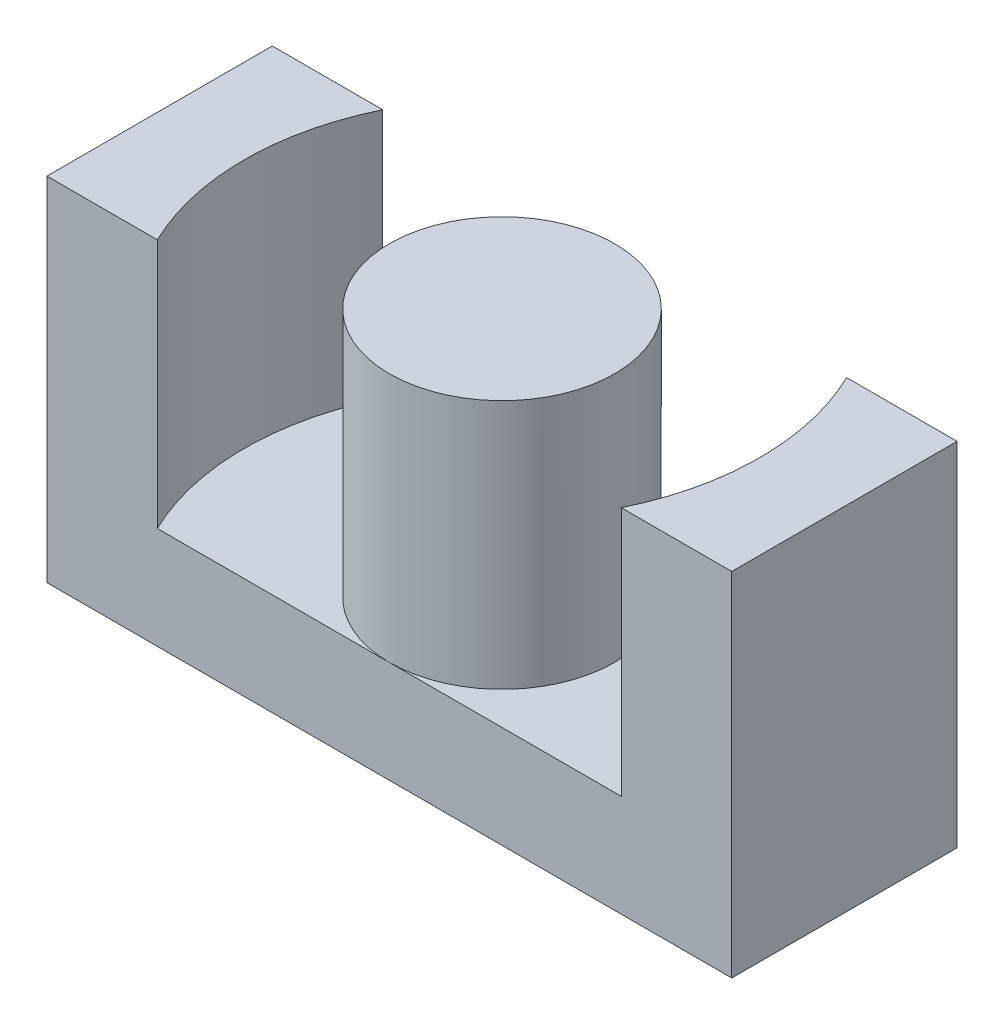
ISO-10303-21;
HEADER;
FILE_DESCRIPTION(('STEP AP214'),'2;1');
FILE_NAME('part.step','',(''),(''),'','','');
FILE_SCHEMA(('AUTOMOTIVE_DESIGN { 1 0 10303 214 1 1 1 1 }'));
ENDSEC;
DATA;
#1=APPLICATION_CONTEXT('core data for automotive mechanical design processes');
#2=APPLICATION_PROTOCOL_DEFINITION('international standard','automotive_design',2000,#1);
#3=PRODUCT_CONTEXT('',#1,'mechanical');
#4=PRODUCT('Part','Part','',(#3));
#5=PRODUCT_RELATED_PRODUCT_CATEGORY('part','',(#4));
#6=PRODUCT_DEFINITION_FORMATION('','',#4);
#7=PRODUCT_DEFINITION_CONTEXT('part definition',#1,'design');
#8=PRODUCT_DEFINITION('design','',#6,#7);
#9=PRODUCT_DEFINITION_SHAPE('','',#8);
#10=(LENGTH_UNIT() NAMED_UNIT(*) SI_UNIT(.MILLI.,.METRE.));
#11=(NAMED_UNIT(*) PLANE_ANGLE_UNIT() SI_UNIT($,.RADIAN.));
#12=(NAMED_UNIT(*) SI_UNIT($,.STERADIAN.) SOLID_ANGLE_UNIT());
#13=UNCERTAINTY_MEASURE_WITH_UNIT(LENGTH_MEASURE(1.E-05),#10,'distance_accuracy_value','');
#14=(GEOMETRIC_REPRESENTATION_CONTEXT(3) GLOBAL_UNCERTAINTY_ASSIGNED_CONTEXT((#13)) GLOBAL_UNIT_ASSIGNED_CONTEXT((#10,
#11,#12)) REPRESENTATION_CONTEXT('',''));
#15=CARTESIAN_POINT('',(0.,0.,0.));
#16=DIRECTION('',(0.,0.,1.));
#17=DIRECTION('',(1.,0.,0.));
#18=AXIS2_PLACEMENT_3D('',#15,#16,#17);
#19=CARTESIAN_POINT('',(0.,5.8,0.));
#20=DIRECTION('',(0.,1.,0.));
#21=DIRECTION('',(0.,0.,1.));
#22=AXIS2_PLACEMENT_3D('',#19,#20,#21);
#23=PLANE('',#22);
#24=DIRECTION('',(1.,0.,0.));
#25=VECTOR('',#24,1.);
#26=CARTESIAN_POINT('',(-19.45,5.8,6.4));
#27=LINE('',#26,#25);
#28=CARTESIAN_POINT('',(-13.1781068443081,5.8,6.4));
#29=VERTEX_POINT('',#28);
#30=CARTESIAN_POINT('',(0.,5.8,6.4));
#31=VERTEX_POINT('',#30);
#32=EDGE_CURVE('E164',#29,#31,#27,.T.);
#33=ORIENTED_EDGE('',*,*,#32,.T.);
#34=CARTESIAN_POINT('',(0.,5.8,0.));
#35=DIRECTION('',(0.,1.,0.));
#36=DIRECTION('',(0.,0.,1.));
#37=AXIS2_PLACEMENT_3D('',#34,#35,#36);
#38=CIRCLE('',#37,6.4);
#39=CARTESIAN_POINT('',(0.,5.8,-6.4));
#40=VERTEX_POINT('',#39);
#41=EDGE_CURVE('E115',#40,#31,#38,.T.);
#42=ORIENTED_EDGE('',*,*,#41,.F.);
#43=DIRECTION('',(-1.,0.,0.));
#44=VECTOR('',#43,1.);
#45=CARTESIAN_POINT('',(-19.45,5.8,-6.4));
#46=LINE('',#45,#44);
#47=CARTESIAN_POINT('',(-13.1781068443081,5.8,-6.4));
#48=VERTEX_POINT('',#47);
#49=EDGE_CURVE('E174',#40,#48,#46,.T.);
#50=ORIENTED_EDGE('',*,*,#49,.T.);
#51=CARTESIAN_POINT('',(0.,5.8,0.));
#52=DIRECTION('',(0.,1.,0.));
#53=DIRECTION('',(0.,0.,1.));
#54=AXIS2_PLACEMENT_3D('',#51,#52,#53);
#55=CIRCLE('',#54,14.65);
#56=EDGE_CURVE('E141',#48,#29,#55,.T.);
#57=ORIENTED_EDGE('',*,*,#56,.T.);
#58=EDGE_LOOP('',(#33,#42,#50,#57));
#59=FACE_BOUND('',#58,.T.);
#60=ADVANCED_FACE('F35',(#59),#23,.T.);
#61=CARTESIAN_POINT('',(0.,5.8,0.));
#62=DIRECTION('',(0.,1.,0.));
#63=DIRECTION('',(0.,0.,1.));
#64=AXIS2_PLACEMENT_3D('',#61,#62,#63);
#65=CIRCLE('',#64,14.65);
#66=CARTESIAN_POINT('',(13.1781068443081,5.8,6.4));
#67=VERTEX_POINT('',#66);
#68=CARTESIAN_POINT('',(13.1781068443081,5.8,-6.4));
#69=VERTEX_POINT('',#68);
#70=EDGE_CURVE('E53',#67,#69,#65,.T.);
#71=ORIENTED_EDGE('',*,*,#70,.T.);
#72=EDGE_CURVE('E39',#69,#40,#46,.T.);
#73=ORIENTED_EDGE('',*,*,#72,.T.);
#74=EDGE_CURVE('E142',#31,#40,#38,.T.);
#75=ORIENTED_EDGE('',*,*,#74,.F.);
#76=EDGE_CURVE('E58',#31,#67,#27,.T.);
#77=ORIENTED_EDGE('',*,*,#76,.T.);
#78=EDGE_LOOP('',(#71,#73,#75,#77));
#79=FACE_BOUND('',#78,.T.);
#80=ADVANCED_FACE('F228',(#79),#23,.T.);
#81=CARTESIAN_POINT('',(19.45,5.8,-6.4));
#82=DIRECTION('',(-1.,0.,0.));
#83=DIRECTION('',(0.,0.,1.));
#84=AXIS2_PLACEMENT_3D('',#81,#82,#83);
#85=PLANE('',#84);
#86=DIRECTION('',(0.,0.,-1.));
#87=VECTOR('',#86,1.);
#88=CARTESIAN_POINT('',(19.45,0.,-6.4));
#89=LINE('',#88,#87);
#90=CARTESIAN_POINT('',(19.45,0.,6.4));
#91=VERTEX_POINT('',#90);
#92=CARTESIAN_POINT('',(19.45,0.,-6.4));
#93=VERTEX_POINT('',#92);
#94=EDGE_CURVE('E171',#91,#93,#89,.T.);
#95=ORIENTED_EDGE('',*,*,#94,.T.);
#96=DIRECTION('',(0.,-1.,0.));
#97=VECTOR('',#96,1.);
#98=CARTESIAN_POINT('',(19.45,5.8,-6.4));
#99=LINE('',#98,#97);
#100=CARTESIAN_POINT('',(19.45,20.,-6.4));
#101=VERTEX_POINT('',#100);
#102=EDGE_CURVE('E11',#101,#93,#99,.T.);
#103=ORIENTED_EDGE('',*,*,#102,.F.);
#104=DIRECTION('',(0.,0.,-1.));
#105=VECTOR('',#104,1.);
#106=CARTESIAN_POINT('',(19.45,20.,0.));
#107=LINE('',#106,#105);
#108=CARTESIAN_POINT('',(19.45,20.,6.4));
#109=VERTEX_POINT('',#108);
#110=EDGE_CURVE('E126',#109,#101,#107,.T.);
#111=ORIENTED_EDGE('',*,*,#110,.F.);
#112=DIRECTION('',(0.,-1.,0.));
#113=VECTOR('',#112,1.);
#114=CARTESIAN_POINT('',(19.45,5.8,6.4));
#115=LINE('',#114,#113);
#116=EDGE_CURVE('E122',#109,#91,#115,.T.);
#117=ORIENTED_EDGE('',*,*,#116,.T.);
#118=EDGE_LOOP('',(#95,#103,#111,#117));
#119=FACE_BOUND('',#118,.T.);
#120=ADVANCED_FACE('F37',(#119),#85,.F.);
#121=CARTESIAN_POINT('',(-19.45,5.8,-6.4));
#122=DIRECTION('',(0.,0.,1.));
#123=DIRECTION('',(1.,0.,0.));
#124=AXIS2_PLACEMENT_3D('',#121,#122,#123);
#125=PLANE('',#124);
#126=DIRECTION('',(-1.,0.,0.));
#127=VECTOR('',#126,1.);
#128=CARTESIAN_POINT('',(-19.45,0.,-6.4));
#129=LINE('',#128,#127);
#130=CARTESIAN_POINT('',(-19.45,0.,-6.4));
#131=VERTEX_POINT('',#130);
#132=EDGE_CURVE('E180',#93,#131,#129,.T.);
#133=ORIENTED_EDGE('',*,*,#132,.T.);
#134=DIRECTION('',(0.,-1.,0.));
#135=VECTOR('',#134,1.);
#136=CARTESIAN_POINT('',(-19.45,5.8,-6.4));
#137=LINE('',#136,#135);
#138=CARTESIAN_POINT('',(-19.45,20.,-6.4));
#139=VERTEX_POINT('',#138);
#140=EDGE_CURVE('E45',#139,#131,#137,.T.);
#141=ORIENTED_EDGE('',*,*,#140,.F.);
#142=DIRECTION('',(-1.,0.,0.));
#143=VECTOR('',#142,1.);
#144=CARTESIAN_POINT('',(0.,20.,-6.4));
#145=LINE('',#144,#143);
#146=CARTESIAN_POINT('',(-13.1781068443081,20.,-6.4));
#147=VERTEX_POINT('',#146);
#148=EDGE_CURVE('E148',#147,#139,#145,.T.);
#149=ORIENTED_EDGE('',*,*,#148,.F.);
#150=DIRECTION('',(0.,-1.,0.));
#151=VECTOR('',#150,1.);
#152=CARTESIAN_POINT('',(-13.1781068443081,20.,-6.4));
#153=LINE('',#152,#151);
#154=EDGE_CURVE('E166',#147,#48,#153,.T.);
#155=ORIENTED_EDGE('',*,*,#154,.T.);
#156=ORIENTED_EDGE('',*,*,#49,.F.);
#157=ORIENTED_EDGE('',*,*,#72,.F.);
#158=DIRECTION('',(0.,-1.,0.));
#159=VECTOR('',#158,1.);
#160=CARTESIAN_POINT('',(13.1781068443081,20.,-6.4));
#161=LINE('',#160,#159);
#162=CARTESIAN_POINT('',(13.1781068443081,20.,-6.4));
#163=VERTEX_POINT('',#162);
#164=EDGE_CURVE('E116',#163,#69,#161,.T.);
#165=ORIENTED_EDGE('',*,*,#164,.F.);
#166=DIRECTION('',(-1.,0.,0.));
#167=VECTOR('',#166,1.);
#168=CARTESIAN_POINT('',(0.,20.,-6.4));
#169=LINE('',#168,#167);
#170=EDGE_CURVE('E130',#101,#163,#169,.T.);
#171=ORIENTED_EDGE('',*,*,#170,.F.);
#172=ORIENTED_EDGE('',*,*,#102,.T.);
#173=EDGE_LOOP('',(#133,#141,#149,#155,#156,#157,#165,#171,#172));
#174=FACE_BOUND('',#173,.T.);
#175=ADVANCED_FACE('F203',(#174),#125,.F.);
#176=CARTESIAN_POINT('',(-19.45,5.8,-6.4));
#177=DIRECTION('',(1.,0.,0.));
#178=DIRECTION('',(0.,0.,-1.));
#179=AXIS2_PLACEMENT_3D('',#176,#177,#178);
#180=PLANE('',#179);
#181=DIRECTION('',(0.,0.,1.));
#182=VECTOR('',#181,1.);
#183=CARTESIAN_POINT('',(-19.45,0.,-6.4));
#184=LINE('',#183,#182);
#185=CARTESIAN_POINT('',(-19.45,0.,6.4));
#186=VERTEX_POINT('',#185);
#187=EDGE_CURVE('E182',#131,#186,#184,.T.);
#188=ORIENTED_EDGE('',*,*,#187,.T.);
#189=DIRECTION('',(0.,-1.,0.));
#190=VECTOR('',#189,1.);
#191=CARTESIAN_POINT('',(-19.45,5.8,6.4));
#192=LINE('',#191,#190);
#193=CARTESIAN_POINT('',(-19.45,20.,6.4));
#194=VERTEX_POINT('',#193);
#195=EDGE_CURVE('E187',#194,#186,#192,.T.);
#196=ORIENTED_EDGE('',*,*,#195,.F.);
#197=DIRECTION('',(0.,0.,1.));
#198=VECTOR('',#197,1.);
#199=CARTESIAN_POINT('',(-19.45,20.,0.));
#200=LINE('',#199,#198);
#201=EDGE_CURVE('E151',#139,#194,#200,.T.);
#202=ORIENTED_EDGE('',*,*,#201,.F.);
#203=ORIENTED_EDGE('',*,*,#140,.T.);
#204=EDGE_LOOP('',(#188,#196,#202,#203));
#205=FACE_BOUND('',#204,.T.);
#206=ADVANCED_FACE('F194',(#205),#180,.F.);
#207=CARTESIAN_POINT('',(-19.45,5.8,6.4));
#208=DIRECTION('',(0.,0.,-1.));
#209=DIRECTION('',(-1.,0.,0.));
#210=AXIS2_PLACEMENT_3D('',#207,#208,#209);
#211=PLANE('',#210);
#212=DIRECTION('',(1.,0.,0.));
#213=VECTOR('',#212,1.);
#214=CARTESIAN_POINT('',(-19.45,0.,6.4));
#215=LINE('',#214,#213);
#216=EDGE_CURVE('E184',#186,#91,#215,.T.);
#217=ORIENTED_EDGE('',*,*,#216,.T.);
#218=ORIENTED_EDGE('',*,*,#116,.F.);
#219=DIRECTION('',(1.,0.,0.));
#220=VECTOR('',#219,1.);
#221=CARTESIAN_POINT('',(0.,20.,6.4));
#222=LINE('',#221,#220);
#223=CARTESIAN_POINT('',(13.1781068443081,20.,6.4));
#224=VERTEX_POINT('',#223);
#225=EDGE_CURVE('E119',#224,#109,#222,.T.);
#226=ORIENTED_EDGE('',*,*,#225,.F.);
#227=DIRECTION('',(0.,-1.,0.));
#228=VECTOR('',#227,1.);
#229=CARTESIAN_POINT('',(13.1781068443081,20.,6.4));
#230=LINE('',#229,#228);
#231=EDGE_CURVE('E108',#224,#67,#230,.T.);
#232=ORIENTED_EDGE('',*,*,#231,.T.);
#233=ORIENTED_EDGE('',*,*,#76,.F.);
#234=ORIENTED_EDGE('',*,*,#32,.F.);
#235=DIRECTION('',(0.,-1.,0.));
#236=VECTOR('',#235,1.);
#237=CARTESIAN_POINT('',(-13.1781068443081,20.,6.4));
#238=LINE('',#237,#236);
#239=CARTESIAN_POINT('',(-13.1781068443081,20.,6.4));
#240=VERTEX_POINT('',#239);
#241=EDGE_CURVE('E156',#240,#29,#238,.T.);
#242=ORIENTED_EDGE('',*,*,#241,.F.);
#243=DIRECTION('',(1.,0.,0.));
#244=VECTOR('',#243,1.);
#245=CARTESIAN_POINT('',(0.,20.,6.4));
#246=LINE('',#245,#244);
#247=EDGE_CURVE('E154',#194,#240,#246,.T.);
#248=ORIENTED_EDGE('',*,*,#247,.F.);
#249=ORIENTED_EDGE('',*,*,#195,.T.);
#250=EDGE_LOOP('',(#217,#218,#226,#232,#233,#234,#242,#248,#249));
#251=FACE_BOUND('',#250,.T.);
#252=ADVANCED_FACE('F120',(#251),#211,.F.);
#253=CARTESIAN_POINT('',(0.,0.,0.));
#254=DIRECTION('',(0.,1.,0.));
#255=DIRECTION('',(0.,0.,1.));
#256=AXIS2_PLACEMENT_3D('',#253,#254,#255);
#257=PLANE('',#256);
#258=ORIENTED_EDGE('',*,*,#94,.F.);
#259=ORIENTED_EDGE('',*,*,#216,.F.);
#260=ORIENTED_EDGE('',*,*,#187,.F.);
#261=ORIENTED_EDGE('',*,*,#132,.F.);
#262=EDGE_LOOP('',(#258,#259,#260,#261));
#263=FACE_BOUND('',#262,.T.);
#264=ADVANCED_FACE('F200',(#263),#257,.F.);
#265=CARTESIAN_POINT('',(0.,20.,0.));
#266=DIRECTION('',(0.,-1.,0.));
#267=DIRECTION('',(0.,0.,-1.));
#268=AXIS2_PLACEMENT_3D('',#265,#266,#267);
#269=CYLINDRICAL_SURFACE('',#268,14.65);
#270=ORIENTED_EDGE('',*,*,#56,.F.);
#271=ORIENTED_EDGE('',*,*,#154,.F.);
#272=CARTESIAN_POINT('',(0.,20.,0.));
#273=DIRECTION('',(0.,1.,0.));
#274=DIRECTION('',(0.,0.,1.));
#275=AXIS2_PLACEMENT_3D('',#272,#273,#274);
#276=CIRCLE('',#275,14.65);
#277=EDGE_CURVE('E145',#147,#240,#276,.T.);
#278=ORIENTED_EDGE('',*,*,#277,.T.);
#279=ORIENTED_EDGE('',*,*,#241,.T.);
#280=EDGE_LOOP('',(#270,#271,#278,#279));
#281=FACE_BOUND('',#280,.T.);
#282=ADVANCED_FACE('F212',(#281),#269,.F.);
#283=CARTESIAN_POINT('',(0.,20.,0.));
#284=DIRECTION('',(0.,1.,0.));
#285=DIRECTION('',(0.,0.,1.));
#286=AXIS2_PLACEMENT_3D('',#283,#284,#285);
#287=PLANE('',#286);
#288=ORIENTED_EDGE('',*,*,#277,.F.);
#289=ORIENTED_EDGE('',*,*,#148,.T.);
#290=ORIENTED_EDGE('',*,*,#201,.T.);
#291=ORIENTED_EDGE('',*,*,#247,.T.);
#292=EDGE_LOOP('',(#288,#289,#290,#291));
#293=FACE_BOUND('',#292,.T.);
#294=ADVANCED_FACE('F215',(#293),#287,.T.);
#295=CARTESIAN_POINT('',(0.,20.,0.));
#296=DIRECTION('',(0.,-1.,0.));
#297=DIRECTION('',(0.,0.,-1.));
#298=AXIS2_PLACEMENT_3D('',#295,#296,#297);
#299=CYLINDRICAL_SURFACE('',#298,6.4);
#300=CARTESIAN_POINT('',(0.,20.,0.));
#301=DIRECTION('',(0.,1.,0.));
#302=DIRECTION('',(0.,0.,1.));
#303=AXIS2_PLACEMENT_3D('',#300,#301,#302);
#304=CIRCLE('',#303,6.4);
#305=CARTESIAN_POINT('',(0.,20.,6.4));
#306=VERTEX_POINT('',#305);
#307=EDGE_CURVE('E138',#306,#306,#304,.T.);
#308=ORIENTED_EDGE('',*,*,#307,.F.);
#309=EDGE_LOOP('',(#308));
#310=FACE_BOUND('',#309,.T.);
#311=ORIENTED_EDGE('',*,*,#74,.T.);
#312=ORIENTED_EDGE('',*,*,#41,.T.);
#313=EDGE_LOOP('',(#311,#312));
#314=FACE_BOUND('',#313,.T.);
#315=ADVANCED_FACE('F217',(#310,#314),#299,.T.);
#316=CARTESIAN_POINT('',(0.,20.,0.));
#317=DIRECTION('',(0.,1.,0.));
#318=DIRECTION('',(0.,0.,1.));
#319=AXIS2_PLACEMENT_3D('',#316,#317,#318);
#320=PLANE('',#319);
#321=ORIENTED_EDGE('',*,*,#307,.T.);
#322=EDGE_LOOP('',(#321));
#323=FACE_BOUND('',#322,.T.);
#324=ADVANCED_FACE('F223',(#323),#320,.T.);
#325=CARTESIAN_POINT('',(0.,20.,0.));
#326=DIRECTION('',(0.,-1.,0.));
#327=DIRECTION('',(0.,0.,-1.));
#328=AXIS2_PLACEMENT_3D('',#325,#326,#327);
#329=CYLINDRICAL_SURFACE('',#328,14.65);
#330=ORIENTED_EDGE('',*,*,#70,.F.);
#331=ORIENTED_EDGE('',*,*,#231,.F.);
#332=CARTESIAN_POINT('',(0.,20.,0.));
#333=DIRECTION('',(0.,1.,0.));
#334=DIRECTION('',(0.,0.,1.));
#335=AXIS2_PLACEMENT_3D('',#332,#333,#334);
#336=CIRCLE('',#335,14.65);
#337=EDGE_CURVE('E113',#224,#163,#336,.T.);
#338=ORIENTED_EDGE('',*,*,#337,.T.);
#339=ORIENTED_EDGE('',*,*,#164,.T.);
#340=EDGE_LOOP('',(#330,#331,#338,#339));
#341=FACE_BOUND('',#340,.T.);
#342=ADVANCED_FACE('F110',(#341),#329,.F.);
#343=CARTESIAN_POINT('',(0.,20.,0.));
#344=DIRECTION('',(0.,1.,0.));
#345=DIRECTION('',(0.,0.,1.));
#346=AXIS2_PLACEMENT_3D('',#343,#344,#345);
#347=PLANE('',#346);
#348=ORIENTED_EDGE('',*,*,#337,.F.);
#349=ORIENTED_EDGE('',*,*,#225,.T.);
#350=ORIENTED_EDGE('',*,*,#110,.T.);
#351=ORIENTED_EDGE('',*,*,#170,.T.);
#352=EDGE_LOOP('',(#348,#349,#350,#351));
#353=FACE_BOUND('',#352,.T.);
#354=ADVANCED_FACE('F128',(#353),#347,.T.);
#355=CLOSED_SHELL('',(#60,#80,#120,#175,#206,#252,#264,#282,#294,#315,#324,#342,#354));
#356=MANIFOLD_SOLID_BREP('B2',#355);
#357=ADVANCED_BREP_SHAPE_REPRESENTATION('',(#18,#356),#14);
#358=SHAPE_DEFINITION_REPRESENTATION(#9,#357);
ENDSEC;
END-ISO-10303-21;
